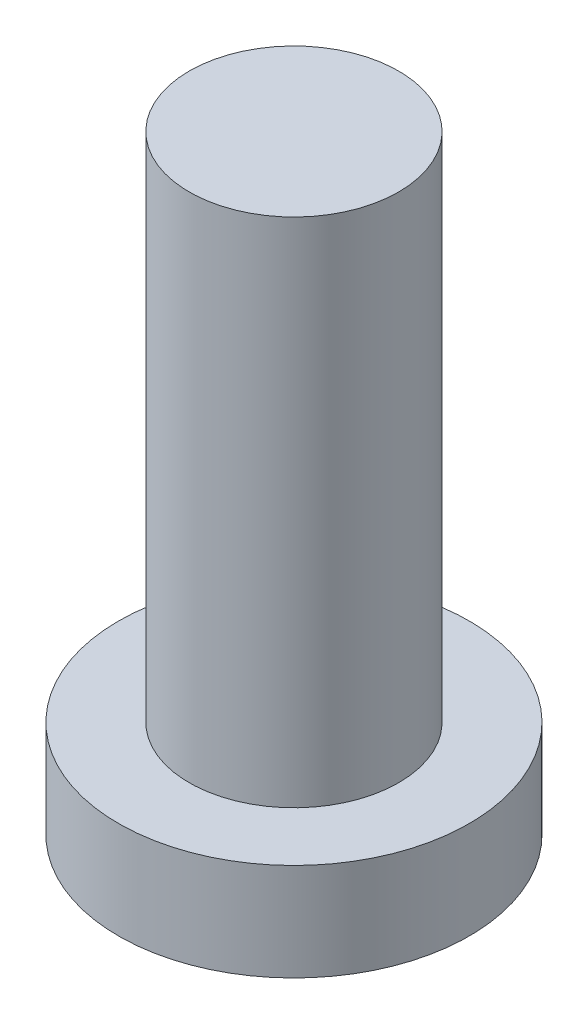
ISO-10303-21;
HEADER;
FILE_DESCRIPTION(('STEP AP214'),'2;1');
FILE_NAME('part.step','',(''),(''),'','','');
FILE_SCHEMA(('AUTOMOTIVE_DESIGN { 1 0 10303 214 1 1 1 1 }'));
ENDSEC;
DATA;
#1=APPLICATION_CONTEXT('core data for automotive mechanical design processes');
#2=APPLICATION_PROTOCOL_DEFINITION('international standard','automotive_design',2000,#1);
#3=PRODUCT_CONTEXT('',#1,'mechanical');
#4=PRODUCT('Part','Part','',(#3));
#5=PRODUCT_RELATED_PRODUCT_CATEGORY('part','',(#4));
#6=PRODUCT_DEFINITION_FORMATION('','',#4);
#7=PRODUCT_DEFINITION_CONTEXT('part definition',#1,'design');
#8=PRODUCT_DEFINITION('design','',#6,#7);
#9=PRODUCT_DEFINITION_SHAPE('','',#8);
#10=(LENGTH_UNIT() NAMED_UNIT(*) SI_UNIT(.MILLI.,.METRE.));
#11=(NAMED_UNIT(*) PLANE_ANGLE_UNIT() SI_UNIT($,.RADIAN.));
#12=(NAMED_UNIT(*) SI_UNIT($,.STERADIAN.) SOLID_ANGLE_UNIT());
#13=UNCERTAINTY_MEASURE_WITH_UNIT(LENGTH_MEASURE(1.E-05),#10,'distance_accuracy_value','');
#14=(GEOMETRIC_REPRESENTATION_CONTEXT(3) GLOBAL_UNCERTAINTY_ASSIGNED_CONTEXT((#13)) GLOBAL_UNIT_ASSIGNED_CONTEXT((#10,
#11,#12)) REPRESENTATION_CONTEXT('',''));
#15=CARTESIAN_POINT('',(0.,0.,0.));
#16=DIRECTION('',(0.,0.,1.));
#17=DIRECTION('',(1.,0.,0.));
#18=AXIS2_PLACEMENT_3D('',#15,#16,#17);
#19=CARTESIAN_POINT('',(0.,0.,0.));
#20=DIRECTION('',(0.,1.,0.));
#21=DIRECTION('',(-1.,0.,0.));
#22=AXIS2_PLACEMENT_3D('',#19,#20,#21);
#23=PLANE('',#22);
#24=CARTESIAN_POINT('',(0.,0.,0.));
#25=DIRECTION('',(0.,1.,0.));
#26=DIRECTION('',(-1.,0.,0.));
#27=AXIS2_PLACEMENT_3D('',#24,#25,#26);
#28=CIRCLE('',#27,1.8288);
#29=CARTESIAN_POINT('',(-1.82879999999999,0.,0.));
#30=VERTEX_POINT('',#29);
#31=EDGE_CURVE('E10',#30,#30,#28,.T.);
#32=ORIENTED_EDGE('',*,*,#31,.F.);
#33=EDGE_LOOP('',(#32));
#34=FACE_BOUND('',#33,.T.);
#35=ADVANCED_FACE('F33',(#34),#23,.F.);
#36=CARTESIAN_POINT('',(0.,48.2105729361976,0.));
#37=DIRECTION('',(0.,1.,0.));
#38=DIRECTION('',(-1.,0.,0.));
#39=AXIS2_PLACEMENT_3D('',#36,#37,#38);
#40=CYLINDRICAL_SURFACE('',#39,1.8288);
#41=CARTESIAN_POINT('',(0.,1.016,0.));
#42=DIRECTION('',(0.,1.,0.));
#43=DIRECTION('',(-1.,0.,0.));
#44=AXIS2_PLACEMENT_3D('',#41,#42,#43);
#45=CIRCLE('',#44,1.8288);
#46=CARTESIAN_POINT('',(-1.82879999999999,1.016,0.));
#47=VERTEX_POINT('',#46);
#48=EDGE_CURVE('E39',#47,#47,#45,.T.);
#49=ORIENTED_EDGE('',*,*,#48,.F.);
#50=EDGE_LOOP('',(#49));
#51=FACE_BOUND('',#50,.T.);
#52=ORIENTED_EDGE('',*,*,#31,.T.);
#53=EDGE_LOOP('',(#52));
#54=FACE_BOUND('',#53,.T.);
#55=ADVANCED_FACE('F63',(#51,#54),#40,.T.);
#56=CARTESIAN_POINT('',(1.82880000000001,1.016,0.));
#57=DIRECTION('',(0.,-1.,0.));
#58=DIRECTION('',(1.,0.,0.));
#59=AXIS2_PLACEMENT_3D('',#56,#57,#58);
#60=PLANE('',#59);
#61=CARTESIAN_POINT('',(0.,1.016,0.));
#62=DIRECTION('',(0.,1.,0.));
#63=DIRECTION('',(-1.,0.,0.));
#64=AXIS2_PLACEMENT_3D('',#61,#62,#63);
#65=CIRCLE('',#64,1.0922);
#66=CARTESIAN_POINT('',(-1.09219999999999,1.016,0.));
#67=VERTEX_POINT('',#66);
#68=EDGE_CURVE('E43',#67,#67,#65,.T.);
#69=ORIENTED_EDGE('',*,*,#68,.F.);
#70=EDGE_LOOP('',(#69));
#71=FACE_BOUND('',#70,.T.);
#72=ORIENTED_EDGE('',*,*,#48,.T.);
#73=EDGE_LOOP('',(#72));
#74=FACE_BOUND('',#73,.T.);
#75=ADVANCED_FACE('F58',(#71,#74),#60,.F.);
#76=CARTESIAN_POINT('',(0.,48.2105729361976,0.));
#77=DIRECTION('',(0.,1.,0.));
#78=DIRECTION('',(-1.,0.,0.));
#79=AXIS2_PLACEMENT_3D('',#76,#77,#78);
#80=CYLINDRICAL_SURFACE('',#79,1.0922);
#81=CARTESIAN_POINT('',(0.,6.34999999999999,0.));
#82=DIRECTION('',(0.,1.,0.));
#83=DIRECTION('',(-1.,0.,0.));
#84=AXIS2_PLACEMENT_3D('',#81,#82,#83);
#85=CIRCLE('',#84,1.0922);
#86=CARTESIAN_POINT('',(-1.0922,6.34999999999999,0.));
#87=VERTEX_POINT('',#86);
#88=EDGE_CURVE('E47',#87,#87,#85,.T.);
#89=ORIENTED_EDGE('',*,*,#88,.F.);
#90=EDGE_LOOP('',(#89));
#91=FACE_BOUND('',#90,.T.);
#92=ORIENTED_EDGE('',*,*,#68,.T.);
#93=EDGE_LOOP('',(#92));
#94=FACE_BOUND('',#93,.T.);
#95=ADVANCED_FACE('F55',(#91,#94),#80,.T.);
#96=CARTESIAN_POINT('',(1.09220000000001,6.34999999999999,0.));
#97=DIRECTION('',(0.,-1.,0.));
#98=DIRECTION('',(1.,0.,0.));
#99=AXIS2_PLACEMENT_3D('',#96,#97,#98);
#100=PLANE('',#99);
#101=ORIENTED_EDGE('',*,*,#88,.T.);
#102=EDGE_LOOP('',(#101));
#103=FACE_BOUND('',#102,.T.);
#104=ADVANCED_FACE('F53',(#103),#100,.F.);
#105=CLOSED_SHELL('',(#35,#55,#75,#95,#104));
#106=MANIFOLD_SOLID_BREP('B2',#105);
#107=ADVANCED_BREP_SHAPE_REPRESENTATION('',(#18,#106),#14);
#108=SHAPE_DEFINITION_REPRESENTATION(#9,#107);
ENDSEC;
END-ISO-10303-21;
